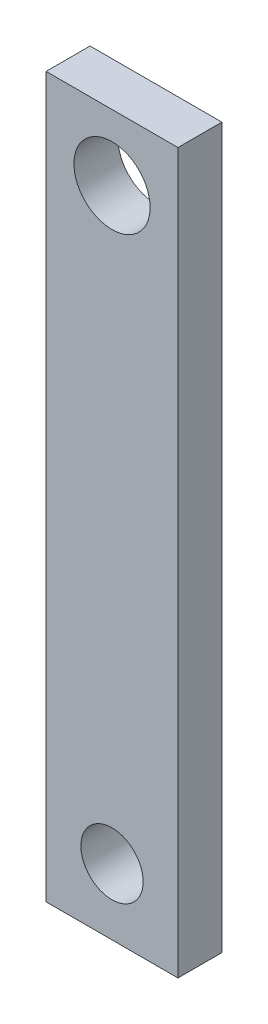
ISO-10303-21;
HEADER;
FILE_DESCRIPTION(('STEP AP214'),'2;1');
FILE_NAME('part.step','',(''),(''),'','','');
FILE_SCHEMA(('AUTOMOTIVE_DESIGN { 1 0 10303 214 1 1 1 1 }'));
ENDSEC;
DATA;
#1=APPLICATION_CONTEXT('core data for automotive mechanical design processes');
#2=APPLICATION_PROTOCOL_DEFINITION('international standard','automotive_design',2000,#1);
#3=PRODUCT_CONTEXT('',#1,'mechanical');
#4=PRODUCT('Part','Part','',(#3));
#5=PRODUCT_RELATED_PRODUCT_CATEGORY('part','',(#4));
#6=PRODUCT_DEFINITION_FORMATION('','',#4);
#7=PRODUCT_DEFINITION_CONTEXT('part definition',#1,'design');
#8=PRODUCT_DEFINITION('design','',#6,#7);
#9=PRODUCT_DEFINITION_SHAPE('','',#8);
#10=(LENGTH_UNIT() NAMED_UNIT(*) SI_UNIT(.MILLI.,.METRE.));
#11=(NAMED_UNIT(*) PLANE_ANGLE_UNIT() SI_UNIT($,.RADIAN.));
#12=(NAMED_UNIT(*) SI_UNIT($,.STERADIAN.) SOLID_ANGLE_UNIT());
#13=UNCERTAINTY_MEASURE_WITH_UNIT(LENGTH_MEASURE(1.E-05),#10,'distance_accuracy_value','');
#14=(GEOMETRIC_REPRESENTATION_CONTEXT(3) GLOBAL_UNCERTAINTY_ASSIGNED_CONTEXT((#13)) GLOBAL_UNIT_ASSIGNED_CONTEXT((#10,
#11,#12)) REPRESENTATION_CONTEXT('',''));
#15=CARTESIAN_POINT('',(0.,0.,0.));
#16=DIRECTION('',(0.,0.,1.));
#17=DIRECTION('',(1.,0.,0.));
#18=AXIS2_PLACEMENT_3D('',#15,#16,#17);
#19=CARTESIAN_POINT('',(9.525,-136.667,6.35));
#20=DIRECTION('',(0.,-1.,0.));
#21=DIRECTION('',(0.,0.,-1.));
#22=AXIS2_PLACEMENT_3D('',#19,#20,#21);
#23=PLANE('',#22);
#24=DIRECTION('',(-1.,0.,0.));
#25=VECTOR('',#24,1.);
#26=CARTESIAN_POINT('',(9.525,-136.667,0.));
#27=LINE('',#26,#25);
#28=CARTESIAN_POINT('',(9.525,-136.667,0.));
#29=VERTEX_POINT('',#28);
#30=CARTESIAN_POINT('',(-9.525,-136.667,0.));
#31=VERTEX_POINT('',#30);
#32=EDGE_CURVE('E111',#29,#31,#27,.T.);
#33=ORIENTED_EDGE('',*,*,#32,.F.);
#34=DIRECTION('',(0.,0.,-1.));
#35=VECTOR('',#34,1.);
#36=CARTESIAN_POINT('',(9.525,-136.667,6.35));
#37=LINE('',#36,#35);
#38=CARTESIAN_POINT('',(9.525,-136.667,6.35));
#39=VERTEX_POINT('',#38);
#40=EDGE_CURVE('E11',#39,#29,#37,.T.);
#41=ORIENTED_EDGE('',*,*,#40,.F.);
#42=DIRECTION('',(-1.,0.,0.));
#43=VECTOR('',#42,1.);
#44=CARTESIAN_POINT('',(9.525,-136.667,6.35));
#45=LINE('',#44,#43);
#46=CARTESIAN_POINT('',(-9.525,-136.667,6.35));
#47=VERTEX_POINT('',#46);
#48=EDGE_CURVE('E103',#39,#47,#45,.T.);
#49=ORIENTED_EDGE('',*,*,#48,.T.);
#50=DIRECTION('',(0.,0.,-1.));
#51=VECTOR('',#50,1.);
#52=CARTESIAN_POINT('',(-9.525,-136.667,6.35));
#53=LINE('',#52,#51);
#54=EDGE_CURVE('E42',#47,#31,#53,.T.);
#55=ORIENTED_EDGE('',*,*,#54,.T.);
#56=EDGE_LOOP('',(#33,#41,#49,#55));
#57=FACE_BOUND('',#56,.T.);
#58=ADVANCED_FACE('F39',(#57),#23,.T.);
#59=CARTESIAN_POINT('',(9.525,-136.667,6.35));
#60=DIRECTION('',(-1.,0.,0.));
#61=DIRECTION('',(0.,0.,1.));
#62=AXIS2_PLACEMENT_3D('',#59,#60,#61);
#63=PLANE('',#62);
#64=DIRECTION('',(0.,1.,0.));
#65=VECTOR('',#64,1.);
#66=CARTESIAN_POINT('',(9.525,-136.667,0.));
#67=LINE('',#66,#65);
#68=CARTESIAN_POINT('',(9.525,-32.7810000000001,0.));
#69=VERTEX_POINT('',#68);
#70=EDGE_CURVE('E73',#29,#69,#67,.T.);
#71=ORIENTED_EDGE('',*,*,#70,.T.);
#72=DIRECTION('',(0.,0.,-1.));
#73=VECTOR('',#72,1.);
#74=CARTESIAN_POINT('',(9.525,-32.7810000000001,6.35));
#75=LINE('',#74,#73);
#76=CARTESIAN_POINT('',(9.525,-32.7810000000001,6.35));
#77=VERTEX_POINT('',#76);
#78=EDGE_CURVE('E49',#77,#69,#75,.T.);
#79=ORIENTED_EDGE('',*,*,#78,.F.);
#80=DIRECTION('',(0.,1.,0.));
#81=VECTOR('',#80,1.);
#82=CARTESIAN_POINT('',(9.525,-136.667,6.35));
#83=LINE('',#82,#81);
#84=EDGE_CURVE('E90',#39,#77,#83,.T.);
#85=ORIENTED_EDGE('',*,*,#84,.F.);
#86=ORIENTED_EDGE('',*,*,#40,.T.);
#87=EDGE_LOOP('',(#71,#79,#85,#86));
#88=FACE_BOUND('',#87,.T.);
#89=ADVANCED_FACE('F128',(#88),#63,.F.);
#90=CARTESIAN_POINT('',(9.525,-32.7810000000001,6.35));
#91=DIRECTION('',(0.,-1.,0.));
#92=DIRECTION('',(0.,0.,-1.));
#93=AXIS2_PLACEMENT_3D('',#90,#91,#92);
#94=PLANE('',#93);
#95=DIRECTION('',(-1.,0.,0.));
#96=VECTOR('',#95,1.);
#97=CARTESIAN_POINT('',(9.525,-32.7810000000001,0.));
#98=LINE('',#97,#96);
#99=CARTESIAN_POINT('',(-9.525,-32.7810000000001,0.));
#100=VERTEX_POINT('',#99);
#101=EDGE_CURVE('E98',#69,#100,#98,.T.);
#102=ORIENTED_EDGE('',*,*,#101,.T.);
#103=DIRECTION('',(0.,0.,-1.));
#104=VECTOR('',#103,1.);
#105=CARTESIAN_POINT('',(-9.525,-32.7810000000001,6.35));
#106=LINE('',#105,#104);
#107=CARTESIAN_POINT('',(-9.525,-32.7810000000001,6.35));
#108=VERTEX_POINT('',#107);
#109=EDGE_CURVE('E95',#108,#100,#106,.T.);
#110=ORIENTED_EDGE('',*,*,#109,.F.);
#111=DIRECTION('',(-1.,0.,0.));
#112=VECTOR('',#111,1.);
#113=CARTESIAN_POINT('',(9.525,-32.7810000000001,6.35));
#114=LINE('',#113,#112);
#115=EDGE_CURVE('E85',#77,#108,#114,.T.);
#116=ORIENTED_EDGE('',*,*,#115,.F.);
#117=ORIENTED_EDGE('',*,*,#78,.T.);
#118=EDGE_LOOP('',(#102,#110,#116,#117));
#119=FACE_BOUND('',#118,.T.);
#120=ADVANCED_FACE('F96',(#119),#94,.F.);
#121=CARTESIAN_POINT('',(-9.525,-136.667,6.35));
#122=DIRECTION('',(-1.,0.,0.));
#123=DIRECTION('',(0.,0.,1.));
#124=AXIS2_PLACEMENT_3D('',#121,#122,#123);
#125=PLANE('',#124);
#126=DIRECTION('',(0.,1.,0.));
#127=VECTOR('',#126,1.);
#128=CARTESIAN_POINT('',(-9.525,-136.667,0.));
#129=LINE('',#128,#127);
#130=EDGE_CURVE('E115',#31,#100,#129,.T.);
#131=ORIENTED_EDGE('',*,*,#130,.F.);
#132=ORIENTED_EDGE('',*,*,#54,.F.);
#133=DIRECTION('',(0.,1.,0.));
#134=VECTOR('',#133,1.);
#135=CARTESIAN_POINT('',(-9.525,-136.667,6.35));
#136=LINE('',#135,#134);
#137=EDGE_CURVE('E89',#47,#108,#136,.T.);
#138=ORIENTED_EDGE('',*,*,#137,.T.);
#139=ORIENTED_EDGE('',*,*,#109,.T.);
#140=EDGE_LOOP('',(#131,#132,#138,#139));
#141=FACE_BOUND('',#140,.T.);
#142=ADVANCED_FACE('F101',(#141),#125,.T.);
#143=CARTESIAN_POINT('',(0.,0.,6.35));
#144=DIRECTION('',(0.,0.,-1.));
#145=DIRECTION('',(-1.,0.,0.));
#146=AXIS2_PLACEMENT_3D('',#143,#144,#145);
#147=PLANE('',#146);
#148=CARTESIAN_POINT('',(1.66533453693773E-13,-42.3060000000001,6.35));
#149=DIRECTION('',(0.,0.,1.));
#150=DIRECTION('',(1.,0.,0.));
#151=AXIS2_PLACEMENT_3D('',#148,#149,#150);
#152=CIRCLE('',#151,5.5);
#153=CARTESIAN_POINT('',(5.50000000000016,-42.3060000000001,6.35));
#154=VERTEX_POINT('',#153);
#155=EDGE_CURVE('E165',#154,#154,#152,.T.);
#156=ORIENTED_EDGE('',*,*,#155,.F.);
#157=EDGE_LOOP('',(#156));
#158=FACE_BOUND('',#157,.T.);
#159=CARTESIAN_POINT('',(2.22044604925031E-13,-127.142,6.35));
#160=DIRECTION('',(0.,0.,1.));
#161=DIRECTION('',(1.,0.,0.));
#162=AXIS2_PLACEMENT_3D('',#159,#160,#161);
#163=CIRCLE('',#162,4.49999999999999);
#164=CARTESIAN_POINT('',(4.50000000000021,-127.142,6.35));
#165=VERTEX_POINT('',#164);
#166=EDGE_CURVE('E169',#165,#165,#163,.T.);
#167=ORIENTED_EDGE('',*,*,#166,.F.);
#168=EDGE_LOOP('',(#167));
#169=FACE_BOUND('',#168,.T.);
#170=ORIENTED_EDGE('',*,*,#48,.F.);
#171=ORIENTED_EDGE('',*,*,#84,.T.);
#172=ORIENTED_EDGE('',*,*,#115,.T.);
#173=ORIENTED_EDGE('',*,*,#137,.F.);
#174=EDGE_LOOP('',(#170,#171,#172,#173));
#175=FACE_BOUND('',#174,.T.);
#176=ADVANCED_FACE('F88',(#158,#169,#175),#147,.F.);
#177=CARTESIAN_POINT('',(0.,0.,0.));
#178=DIRECTION('',(0.,0.,-1.));
#179=DIRECTION('',(-1.,0.,0.));
#180=AXIS2_PLACEMENT_3D('',#177,#178,#179);
#181=PLANE('',#180);
#182=CARTESIAN_POINT('',(1.66533453693773E-13,-42.3060000000001,0.));
#183=DIRECTION('',(0.,0.,-1.));
#184=DIRECTION('',(-1.,0.,0.));
#185=AXIS2_PLACEMENT_3D('',#182,#183,#184);
#186=CIRCLE('',#185,5.5);
#187=CARTESIAN_POINT('',(-5.49999999999983,-42.3060000000001,0.));
#188=VERTEX_POINT('',#187);
#189=EDGE_CURVE('E163',#188,#188,#186,.T.);
#190=ORIENTED_EDGE('',*,*,#189,.F.);
#191=EDGE_LOOP('',(#190));
#192=FACE_BOUND('',#191,.T.);
#193=CARTESIAN_POINT('',(2.22044604925031E-13,-127.142,0.));
#194=DIRECTION('',(0.,0.,-1.));
#195=DIRECTION('',(-1.,0.,0.));
#196=AXIS2_PLACEMENT_3D('',#193,#194,#195);
#197=CIRCLE('',#196,4.49999999999999);
#198=CARTESIAN_POINT('',(-4.49999999999977,-127.142,0.));
#199=VERTEX_POINT('',#198);
#200=EDGE_CURVE('E116',#199,#199,#197,.T.);
#201=ORIENTED_EDGE('',*,*,#200,.F.);
#202=EDGE_LOOP('',(#201));
#203=FACE_BOUND('',#202,.T.);
#204=ORIENTED_EDGE('',*,*,#32,.T.);
#205=ORIENTED_EDGE('',*,*,#130,.T.);
#206=ORIENTED_EDGE('',*,*,#101,.F.);
#207=ORIENTED_EDGE('',*,*,#70,.F.);
#208=EDGE_LOOP('',(#204,#205,#206,#207));
#209=FACE_BOUND('',#208,.T.);
#210=ADVANCED_FACE('F125',(#192,#203,#209),#181,.T.);
#211=CARTESIAN_POINT('',(2.22044604925031E-13,-127.142,6.35));
#212=DIRECTION('',(0.,0.,1.));
#213=DIRECTION('',(1.,0.,0.));
#214=AXIS2_PLACEMENT_3D('',#211,#212,#213);
#215=CYLINDRICAL_SURFACE('',#214,4.49999999999999);
#216=ORIENTED_EDGE('',*,*,#200,.T.);
#217=EDGE_LOOP('',(#216));
#218=FACE_BOUND('',#217,.T.);
#219=ORIENTED_EDGE('',*,*,#166,.T.);
#220=EDGE_LOOP('',(#219));
#221=FACE_BOUND('',#220,.T.);
#222=ADVANCED_FACE('F147',(#218,#221),#215,.F.);
#223=CARTESIAN_POINT('',(1.66533453693773E-13,-42.3060000000001,6.35));
#224=DIRECTION('',(0.,0.,1.));
#225=DIRECTION('',(1.,0.,0.));
#226=AXIS2_PLACEMENT_3D('',#223,#224,#225);
#227=CYLINDRICAL_SURFACE('',#226,5.5);
#228=ORIENTED_EDGE('',*,*,#189,.T.);
#229=EDGE_LOOP('',(#228));
#230=FACE_BOUND('',#229,.T.);
#231=ORIENTED_EDGE('',*,*,#155,.T.);
#232=EDGE_LOOP('',(#231));
#233=FACE_BOUND('',#232,.T.);
#234=ADVANCED_FACE('F154',(#230,#233),#227,.F.);
#235=CLOSED_SHELL('',(#58,#89,#120,#142,#176,#210,#222,#234));
#236=MANIFOLD_SOLID_BREP('B2',#235);
#237=ADVANCED_BREP_SHAPE_REPRESENTATION('',(#18,#236),#14);
#238=SHAPE_DEFINITION_REPRESENTATION(#9,#237);
ENDSEC;
END-ISO-10303-21;
